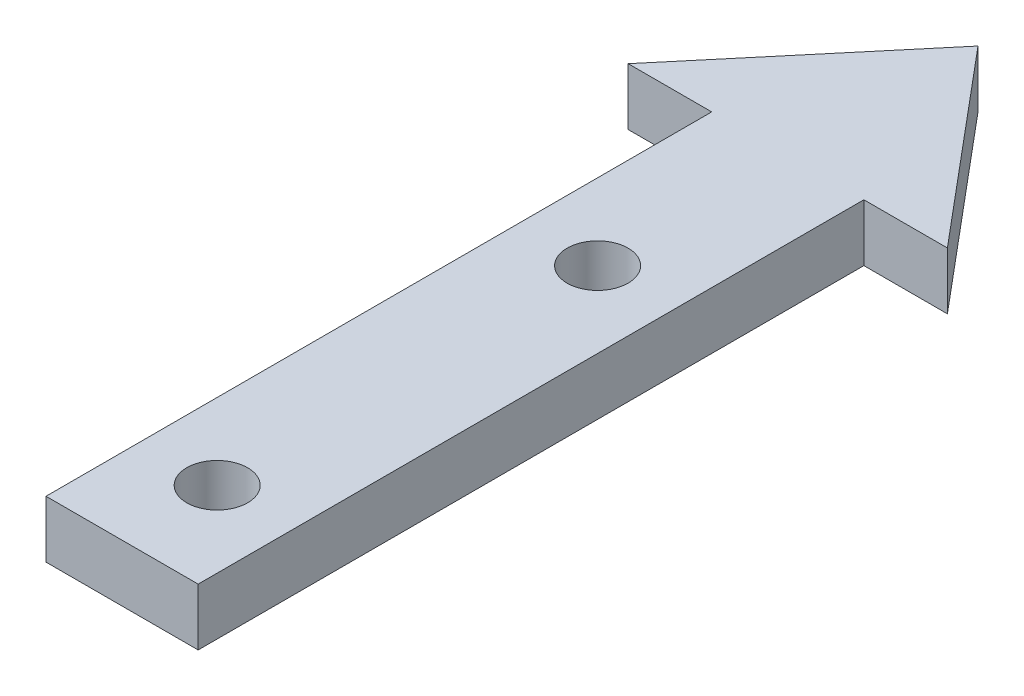
ISO-10303-21;
HEADER;
FILE_DESCRIPTION(('STEP AP214'),'2;1');
FILE_NAME('part.step','',(''),(''),'','','');
FILE_SCHEMA(('AUTOMOTIVE_DESIGN { 1 0 10303 214 1 1 1 1 }'));
ENDSEC;
DATA;
#1=APPLICATION_CONTEXT('core data for automotive mechanical design processes');
#2=APPLICATION_PROTOCOL_DEFINITION('international standard','automotive_design',2000,#1);
#3=PRODUCT_CONTEXT('',#1,'mechanical');
#4=PRODUCT('Part','Part','',(#3));
#5=PRODUCT_RELATED_PRODUCT_CATEGORY('part','',(#4));
#6=PRODUCT_DEFINITION_FORMATION('','',#4);
#7=PRODUCT_DEFINITION_CONTEXT('part definition',#1,'design');
#8=PRODUCT_DEFINITION('design','',#6,#7);
#9=PRODUCT_DEFINITION_SHAPE('','',#8);
#10=(LENGTH_UNIT() NAMED_UNIT(*) SI_UNIT(.MILLI.,.METRE.));
#11=(NAMED_UNIT(*) PLANE_ANGLE_UNIT() SI_UNIT($,.RADIAN.));
#12=(NAMED_UNIT(*) SI_UNIT($,.STERADIAN.) SOLID_ANGLE_UNIT());
#13=UNCERTAINTY_MEASURE_WITH_UNIT(LENGTH_MEASURE(1.E-05),#10,'distance_accuracy_value','');
#14=(GEOMETRIC_REPRESENTATION_CONTEXT(3) GLOBAL_UNCERTAINTY_ASSIGNED_CONTEXT((#13)) GLOBAL_UNIT_ASSIGNED_CONTEXT((#10,
#11,#12)) REPRESENTATION_CONTEXT('',''));
#15=CARTESIAN_POINT('',(0.,0.,0.));
#16=DIRECTION('',(0.,0.,1.));
#17=DIRECTION('',(1.,0.,0.));
#18=AXIS2_PLACEMENT_3D('',#15,#16,#17);
#19=CARTESIAN_POINT('',(0.,3.,-38.2697413928879));
#20=DIRECTION('',(0.,0.,-1.));
#21=DIRECTION('',(-1.,0.,0.));
#22=AXIS2_PLACEMENT_3D('',#19,#20,#21);
#23=PLANE('',#22);
#24=DIRECTION('',(1.,0.,0.));
#25=VECTOR('',#24,1.);
#26=CARTESIAN_POINT('',(0.,0.,-38.2697413928879));
#27=LINE('',#26,#25);
#28=CARTESIAN_POINT('',(-8.3909963117727,0.,-38.2697413928879));
#29=VERTEX_POINT('',#28);
#30=CARTESIAN_POINT('',(-4.,0.,-38.2697413928879));
#31=VERTEX_POINT('',#30);
#32=EDGE_CURVE('E130',#29,#31,#27,.T.);
#33=ORIENTED_EDGE('',*,*,#32,.T.);
#34=DIRECTION('',(0.,-1.,0.));
#35=VECTOR('',#34,1.);
#36=CARTESIAN_POINT('',(-4.,3.,-38.2697413928879));
#37=LINE('',#36,#35);
#38=CARTESIAN_POINT('',(-4.,3.,-38.2697413928879));
#39=VERTEX_POINT('',#38);
#40=EDGE_CURVE('E11',#39,#31,#37,.T.);
#41=ORIENTED_EDGE('',*,*,#40,.F.);
#42=DIRECTION('',(1.,0.,0.));
#43=VECTOR('',#42,1.);
#44=CARTESIAN_POINT('',(0.,3.,-38.2697413928879));
#45=LINE('',#44,#43);
#46=CARTESIAN_POINT('',(-8.3909963117727,3.,-38.2697413928879));
#47=VERTEX_POINT('',#46);
#48=EDGE_CURVE('E84',#47,#39,#45,.T.);
#49=ORIENTED_EDGE('',*,*,#48,.F.);
#50=DIRECTION('',(0.,-1.,0.));
#51=VECTOR('',#50,1.);
#52=CARTESIAN_POINT('',(-8.3909963117727,3.,-38.2697413928879));
#53=LINE('',#52,#51);
#54=EDGE_CURVE('E126',#47,#29,#53,.T.);
#55=ORIENTED_EDGE('',*,*,#54,.T.);
#56=EDGE_LOOP('',(#33,#41,#49,#55));
#57=FACE_BOUND('',#56,.T.);
#58=ADVANCED_FACE('F34',(#57),#23,.F.);
#59=CARTESIAN_POINT('',(-4.,3.,0.));
#60=DIRECTION('',(-1.,0.,0.));
#61=DIRECTION('',(0.,0.,1.));
#62=AXIS2_PLACEMENT_3D('',#59,#60,#61);
#63=PLANE('',#62);
#64=DIRECTION('',(0.,0.,-1.));
#65=VECTOR('',#64,1.);
#66=CARTESIAN_POINT('',(-4.,0.,0.));
#67=LINE('',#66,#65);
#68=CARTESIAN_POINT('',(-4.,0.,-3.26974139288792));
#69=VERTEX_POINT('',#68);
#70=EDGE_CURVE('E133',#69,#31,#67,.T.);
#71=ORIENTED_EDGE('',*,*,#70,.F.);
#72=DIRECTION('',(0.,-1.,0.));
#73=VECTOR('',#72,1.);
#74=CARTESIAN_POINT('',(-4.,3.,-3.26974139288792));
#75=LINE('',#74,#73);
#76=CARTESIAN_POINT('',(-4.,3.,-3.26974139288792));
#77=VERTEX_POINT('',#76);
#78=EDGE_CURVE('E43',#77,#69,#75,.T.);
#79=ORIENTED_EDGE('',*,*,#78,.F.);
#80=DIRECTION('',(0.,0.,-1.));
#81=VECTOR('',#80,1.);
#82=CARTESIAN_POINT('',(-4.,3.,0.));
#83=LINE('',#82,#81);
#84=EDGE_CURVE('E168',#77,#39,#83,.T.);
#85=ORIENTED_EDGE('',*,*,#84,.T.);
#86=ORIENTED_EDGE('',*,*,#40,.T.);
#87=EDGE_LOOP('',(#71,#79,#85,#86));
#88=FACE_BOUND('',#87,.T.);
#89=ADVANCED_FACE('F167',(#88),#63,.T.);
#90=CARTESIAN_POINT('',(0.,3.,-3.26974139288792));
#91=DIRECTION('',(0.,0.,-1.));
#92=DIRECTION('',(-1.,0.,0.));
#93=AXIS2_PLACEMENT_3D('',#90,#91,#92);
#94=PLANE('',#93);
#95=DIRECTION('',(1.,0.,0.));
#96=VECTOR('',#95,1.);
#97=CARTESIAN_POINT('',(0.,0.,-3.26974139288792));
#98=LINE('',#97,#96);
#99=CARTESIAN_POINT('',(4.,0.,-3.26974139288792));
#100=VERTEX_POINT('',#99);
#101=EDGE_CURVE('E136',#69,#100,#98,.T.);
#102=ORIENTED_EDGE('',*,*,#101,.T.);
#103=DIRECTION('',(0.,-1.,0.));
#104=VECTOR('',#103,1.);
#105=CARTESIAN_POINT('',(4.,3.,-3.26974139288792));
#106=LINE('',#105,#104);
#107=CARTESIAN_POINT('',(4.,3.,-3.26974139288792));
#108=VERTEX_POINT('',#107);
#109=EDGE_CURVE('E151',#108,#100,#106,.T.);
#110=ORIENTED_EDGE('',*,*,#109,.F.);
#111=DIRECTION('',(1.,0.,0.));
#112=VECTOR('',#111,1.);
#113=CARTESIAN_POINT('',(0.,3.,-3.26974139288792));
#114=LINE('',#113,#112);
#115=EDGE_CURVE('E158',#77,#108,#114,.T.);
#116=ORIENTED_EDGE('',*,*,#115,.F.);
#117=ORIENTED_EDGE('',*,*,#78,.T.);
#118=EDGE_LOOP('',(#102,#110,#116,#117));
#119=FACE_BOUND('',#118,.T.);
#120=ADVANCED_FACE('F156',(#119),#94,.F.);
#121=CARTESIAN_POINT('',(4.,3.,0.));
#122=DIRECTION('',(-1.,0.,0.));
#123=DIRECTION('',(0.,0.,1.));
#124=AXIS2_PLACEMENT_3D('',#121,#122,#123);
#125=PLANE('',#124);
#126=DIRECTION('',(0.,0.,-1.));
#127=VECTOR('',#126,1.);
#128=CARTESIAN_POINT('',(4.,0.,0.));
#129=LINE('',#128,#127);
#130=CARTESIAN_POINT('',(3.99999999999999,0.,-38.2697413928879));
#131=VERTEX_POINT('',#130);
#132=EDGE_CURVE('E138',#100,#131,#129,.T.);
#133=ORIENTED_EDGE('',*,*,#132,.T.);
#134=DIRECTION('',(0.,-1.,0.));
#135=VECTOR('',#134,1.);
#136=CARTESIAN_POINT('',(3.99999999999999,3.,-38.2697413928879));
#137=LINE('',#136,#135);
#138=CARTESIAN_POINT('',(3.99999999999999,3.,-38.2697413928879));
#139=VERTEX_POINT('',#138);
#140=EDGE_CURVE('E116',#139,#131,#137,.T.);
#141=ORIENTED_EDGE('',*,*,#140,.F.);
#142=DIRECTION('',(0.,0.,-1.));
#143=VECTOR('',#142,1.);
#144=CARTESIAN_POINT('',(4.,3.,0.));
#145=LINE('',#144,#143);
#146=EDGE_CURVE('E103',#108,#139,#145,.T.);
#147=ORIENTED_EDGE('',*,*,#146,.F.);
#148=ORIENTED_EDGE('',*,*,#109,.T.);
#149=EDGE_LOOP('',(#133,#141,#147,#148));
#150=FACE_BOUND('',#149,.T.);
#151=ADVANCED_FACE('F189',(#150),#125,.F.);
#152=CARTESIAN_POINT('',(0.,3.,-38.2697413928879));
#153=DIRECTION('',(0.,0.,-1.));
#154=DIRECTION('',(-1.,0.,0.));
#155=AXIS2_PLACEMENT_3D('',#152,#153,#154);
#156=PLANE('',#155);
#157=DIRECTION('',(1.,0.,0.));
#158=VECTOR('',#157,1.);
#159=CARTESIAN_POINT('',(0.,0.,-38.2697413928879));
#160=LINE('',#159,#158);
#161=CARTESIAN_POINT('',(8.3909963117727,0.,-38.2697413928879));
#162=VERTEX_POINT('',#161);
#163=EDGE_CURVE('E112',#131,#162,#160,.T.);
#164=ORIENTED_EDGE('',*,*,#163,.T.);
#165=DIRECTION('',(0.,-1.,0.));
#166=VECTOR('',#165,1.);
#167=CARTESIAN_POINT('',(8.3909963117727,3.,-38.2697413928879));
#168=LINE('',#167,#166);
#169=CARTESIAN_POINT('',(8.3909963117727,3.,-38.2697413928879));
#170=VERTEX_POINT('',#169);
#171=EDGE_CURVE('E109',#170,#162,#168,.T.);
#172=ORIENTED_EDGE('',*,*,#171,.F.);
#173=DIRECTION('',(1.,0.,0.));
#174=VECTOR('',#173,1.);
#175=CARTESIAN_POINT('',(0.,3.,-38.2697413928879));
#176=LINE('',#175,#174);
#177=EDGE_CURVE('E96',#139,#170,#176,.T.);
#178=ORIENTED_EDGE('',*,*,#177,.F.);
#179=ORIENTED_EDGE('',*,*,#140,.T.);
#180=EDGE_LOOP('',(#164,#172,#178,#179));
#181=FACE_BOUND('',#180,.T.);
#182=ADVANCED_FACE('F110',(#181),#156,.F.);
#183=CARTESIAN_POINT('',(23.7682077798051,3.,-19.9438943817792));
#184=DIRECTION('',(0.766044443118982,0.,-0.642787609686535));
#185=DIRECTION('',(-0.642787609686535,0.,-0.766044443118982));
#186=AXIS2_PLACEMENT_3D('',#183,#184,#185);
#187=PLANE('',#186);
#188=DIRECTION('',(0.642787609686535,0.,0.766044443118982));
#189=VECTOR('',#188,1.);
#190=CARTESIAN_POINT('',(23.7682077798051,0.,-19.9438943817792));
#191=LINE('',#190,#189);
#192=CARTESIAN_POINT('',(0.,0.,-48.2697413928879));
#193=VERTEX_POINT('',#192);
#194=EDGE_CURVE('E141',#193,#162,#191,.T.);
#195=ORIENTED_EDGE('',*,*,#194,.F.);
#196=DIRECTION('',(0.,-1.,0.));
#197=VECTOR('',#196,1.);
#198=CARTESIAN_POINT('',(0.,3.,-48.2697413928879));
#199=LINE('',#198,#197);
#200=CARTESIAN_POINT('',(0.,3.,-48.2697413928879));
#201=VERTEX_POINT('',#200);
#202=EDGE_CURVE('E75',#201,#193,#199,.T.);
#203=ORIENTED_EDGE('',*,*,#202,.F.);
#204=DIRECTION('',(0.642787609686535,0.,0.766044443118982));
#205=VECTOR('',#204,1.);
#206=CARTESIAN_POINT('',(23.7682077798051,3.,-19.9438943817792));
#207=LINE('',#206,#205);
#208=EDGE_CURVE('E101',#201,#170,#207,.T.);
#209=ORIENTED_EDGE('',*,*,#208,.T.);
#210=ORIENTED_EDGE('',*,*,#171,.T.);
#211=EDGE_LOOP('',(#195,#203,#209,#210));
#212=FACE_BOUND('',#211,.T.);
#213=ADVANCED_FACE('F118',(#212),#187,.T.);
#214=CARTESIAN_POINT('',(-23.7682077798051,3.,-19.9438943817792));
#215=DIRECTION('',(0.766044443118982,0.,0.642787609686535));
#216=DIRECTION('',(0.642787609686535,0.,-0.766044443118982));
#217=AXIS2_PLACEMENT_3D('',#214,#215,#216);
#218=PLANE('',#217);
#219=DIRECTION('',(-0.642787609686535,0.,0.766044443118982));
#220=VECTOR('',#219,1.);
#221=CARTESIAN_POINT('',(-23.7682077798051,0.,-19.9438943817792));
#222=LINE('',#221,#220);
#223=EDGE_CURVE('E78',#193,#29,#222,.T.);
#224=ORIENTED_EDGE('',*,*,#223,.T.);
#225=ORIENTED_EDGE('',*,*,#54,.F.);
#226=DIRECTION('',(-0.642787609686535,0.,0.766044443118982));
#227=VECTOR('',#226,1.);
#228=CARTESIAN_POINT('',(-23.7682077798051,3.,-19.9438943817792));
#229=LINE('',#228,#227);
#230=EDGE_CURVE('E51',#201,#47,#229,.T.);
#231=ORIENTED_EDGE('',*,*,#230,.F.);
#232=ORIENTED_EDGE('',*,*,#202,.T.);
#233=EDGE_LOOP('',(#224,#225,#231,#232));
#234=FACE_BOUND('',#233,.T.);
#235=ADVANCED_FACE('F170',(#234),#218,.F.);
#236=CARTESIAN_POINT('',(0.,3.,-8.26974139288792));
#237=DIRECTION('',(0.,-1.,0.));
#238=DIRECTION('',(0.,0.,-1.));
#239=AXIS2_PLACEMENT_3D('',#236,#237,#238);
#240=CYLINDRICAL_SURFACE('',#239,1.6);
#241=CARTESIAN_POINT('',(0.,3.,-8.26974139288792));
#242=DIRECTION('',(0.,1.,0.));
#243=DIRECTION('',(0.,0.,1.));
#244=AXIS2_PLACEMENT_3D('',#241,#242,#243);
#245=CIRCLE('',#244,1.6);
#246=CARTESIAN_POINT('',(0.,3.,-6.66974139288792));
#247=VERTEX_POINT('',#246);
#248=EDGE_CURVE('E147',#247,#247,#245,.T.);
#249=ORIENTED_EDGE('',*,*,#248,.T.);
#250=EDGE_LOOP('',(#249));
#251=FACE_BOUND('',#250,.T.);
#252=CARTESIAN_POINT('',(0.,0.,-8.26974139288792));
#253=DIRECTION('',(0.,1.,0.));
#254=DIRECTION('',(0.,0.,1.));
#255=AXIS2_PLACEMENT_3D('',#252,#253,#254);
#256=CIRCLE('',#255,1.6);
#257=CARTESIAN_POINT('',(0.,0.,-6.66974139288792));
#258=VERTEX_POINT('',#257);
#259=EDGE_CURVE('E127',#258,#258,#256,.T.);
#260=ORIENTED_EDGE('',*,*,#259,.F.);
#261=EDGE_LOOP('',(#260));
#262=FACE_BOUND('',#261,.T.);
#263=ADVANCED_FACE('F36',(#251,#262),#240,.F.);
#264=CARTESIAN_POINT('',(0.,3.,-28.2697413928879));
#265=DIRECTION('',(0.,-1.,0.));
#266=DIRECTION('',(0.,0.,-1.));
#267=AXIS2_PLACEMENT_3D('',#264,#265,#266);
#268=CYLINDRICAL_SURFACE('',#267,1.6);
#269=CARTESIAN_POINT('',(0.,3.,-28.2697413928879));
#270=DIRECTION('',(0.,1.,0.));
#271=DIRECTION('',(0.,0.,1.));
#272=AXIS2_PLACEMENT_3D('',#269,#270,#271);
#273=CIRCLE('',#272,1.6);
#274=CARTESIAN_POINT('',(0.,3.,-26.6697413928879));
#275=VERTEX_POINT('',#274);
#276=EDGE_CURVE('E120',#275,#275,#273,.T.);
#277=ORIENTED_EDGE('',*,*,#276,.T.);
#278=EDGE_LOOP('',(#277));
#279=FACE_BOUND('',#278,.T.);
#280=CARTESIAN_POINT('',(0.,0.,-28.2697413928879));
#281=DIRECTION('',(0.,1.,0.));
#282=DIRECTION('',(0.,0.,1.));
#283=AXIS2_PLACEMENT_3D('',#280,#281,#282);
#284=CIRCLE('',#283,1.6);
#285=CARTESIAN_POINT('',(0.,0.,-26.6697413928879));
#286=VERTEX_POINT('',#285);
#287=EDGE_CURVE('E144',#286,#286,#284,.T.);
#288=ORIENTED_EDGE('',*,*,#287,.F.);
#289=EDGE_LOOP('',(#288));
#290=FACE_BOUND('',#289,.T.);
#291=ADVANCED_FACE('F177',(#279,#290),#268,.F.);
#292=CARTESIAN_POINT('',(0.,3.,0.));
#293=DIRECTION('',(0.,1.,0.));
#294=DIRECTION('',(0.,0.,1.));
#295=AXIS2_PLACEMENT_3D('',#292,#293,#294);
#296=PLANE('',#295);
#297=ORIENTED_EDGE('',*,*,#248,.F.);
#298=EDGE_LOOP('',(#297));
#299=FACE_BOUND('',#298,.T.);
#300=ORIENTED_EDGE('',*,*,#48,.T.);
#301=ORIENTED_EDGE('',*,*,#84,.F.);
#302=ORIENTED_EDGE('',*,*,#115,.T.);
#303=ORIENTED_EDGE('',*,*,#146,.T.);
#304=ORIENTED_EDGE('',*,*,#177,.T.);
#305=ORIENTED_EDGE('',*,*,#208,.F.);
#306=ORIENTED_EDGE('',*,*,#230,.T.);
#307=EDGE_LOOP('',(#300,#301,#302,#303,#304,#305,#306));
#308=FACE_BOUND('',#307,.T.);
#309=ORIENTED_EDGE('',*,*,#276,.F.);
#310=EDGE_LOOP('',(#309));
#311=FACE_BOUND('',#310,.T.);
#312=ADVANCED_FACE('F98',(#299,#308,#311),#296,.T.);
#313=CARTESIAN_POINT('',(0.,0.,0.));
#314=DIRECTION('',(0.,1.,0.));
#315=DIRECTION('',(0.,0.,1.));
#316=AXIS2_PLACEMENT_3D('',#313,#314,#315);
#317=PLANE('',#316);
#318=ORIENTED_EDGE('',*,*,#259,.T.);
#319=EDGE_LOOP('',(#318));
#320=FACE_BOUND('',#319,.T.);
#321=ORIENTED_EDGE('',*,*,#32,.F.);
#322=ORIENTED_EDGE('',*,*,#223,.F.);
#323=ORIENTED_EDGE('',*,*,#194,.T.);
#324=ORIENTED_EDGE('',*,*,#163,.F.);
#325=ORIENTED_EDGE('',*,*,#132,.F.);
#326=ORIENTED_EDGE('',*,*,#101,.F.);
#327=ORIENTED_EDGE('',*,*,#70,.T.);
#328=EDGE_LOOP('',(#321,#322,#323,#324,#325,#326,#327));
#329=FACE_BOUND('',#328,.T.);
#330=ORIENTED_EDGE('',*,*,#287,.T.);
#331=EDGE_LOOP('',(#330));
#332=FACE_BOUND('',#331,.T.);
#333=ADVANCED_FACE('F165',(#320,#329,#332),#317,.F.);
#334=CLOSED_SHELL('',(#58,#89,#120,#151,#182,#213,#235,#263,#291,#312,#333));
#335=MANIFOLD_SOLID_BREP('B2',#334);
#336=ADVANCED_BREP_SHAPE_REPRESENTATION('',(#18,#335),#14);
#337=SHAPE_DEFINITION_REPRESENTATION(#9,#336);
ENDSEC;
END-ISO-10303-21;
